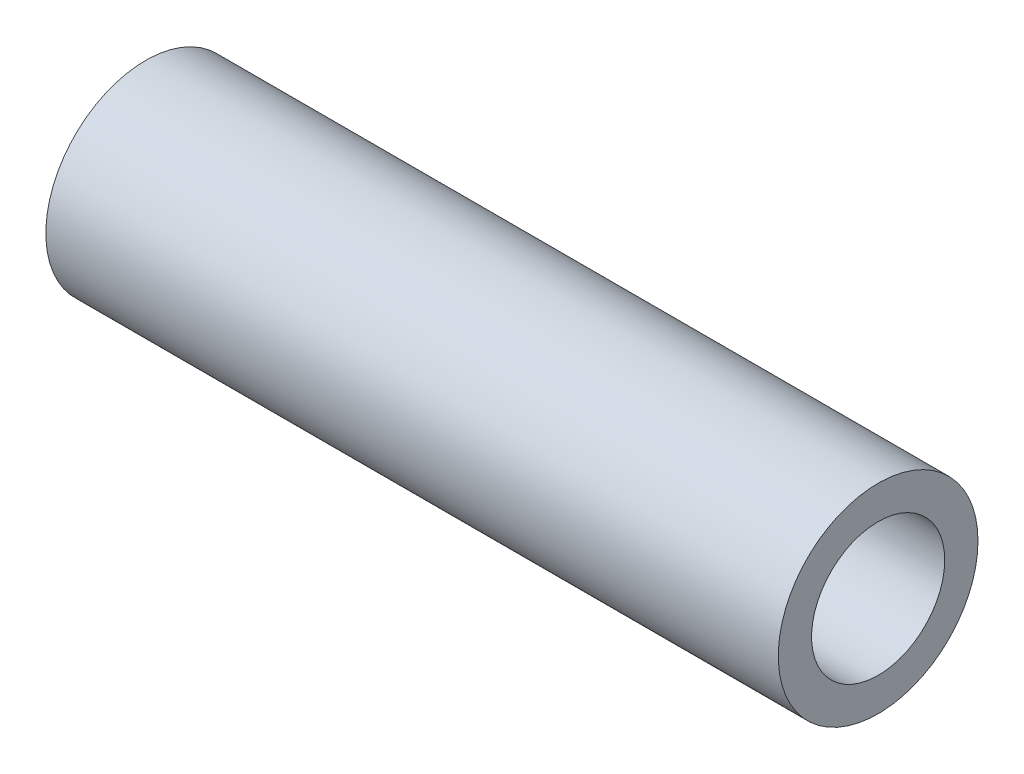
ISO-10303-21;
HEADER;
FILE_DESCRIPTION(('STEP AP214'),'2;1');
FILE_NAME('part.step','',(''),(''),'','','');
FILE_SCHEMA(('AUTOMOTIVE_DESIGN { 1 0 10303 214 1 1 1 1 }'));
ENDSEC;
DATA;
#1=APPLICATION_CONTEXT('core data for automotive mechanical design processes');
#2=APPLICATION_PROTOCOL_DEFINITION('international standard','automotive_design',2000,#1);
#3=PRODUCT_CONTEXT('',#1,'mechanical');
#4=PRODUCT('Part','Part','',(#3));
#5=PRODUCT_RELATED_PRODUCT_CATEGORY('part','',(#4));
#6=PRODUCT_DEFINITION_FORMATION('','',#4);
#7=PRODUCT_DEFINITION_CONTEXT('part definition',#1,'design');
#8=PRODUCT_DEFINITION('design','',#6,#7);
#9=PRODUCT_DEFINITION_SHAPE('','',#8);
#10=(LENGTH_UNIT() NAMED_UNIT(*) SI_UNIT(.MILLI.,.METRE.));
#11=(NAMED_UNIT(*) PLANE_ANGLE_UNIT() SI_UNIT($,.RADIAN.));
#12=(NAMED_UNIT(*) SI_UNIT($,.STERADIAN.) SOLID_ANGLE_UNIT());
#13=UNCERTAINTY_MEASURE_WITH_UNIT(LENGTH_MEASURE(1.E-05),#10,'distance_accuracy_value','');
#14=(GEOMETRIC_REPRESENTATION_CONTEXT(3) GLOBAL_UNCERTAINTY_ASSIGNED_CONTEXT((#13)) GLOBAL_UNIT_ASSIGNED_CONTEXT((#10,
#11,#12)) REPRESENTATION_CONTEXT('',''));
#15=CARTESIAN_POINT('',(0.,0.,0.));
#16=DIRECTION('',(0.,0.,1.));
#17=DIRECTION('',(1.,0.,0.));
#18=AXIS2_PLACEMENT_3D('',#15,#16,#17);
#19=CARTESIAN_POINT('',(-25.87625,0.,0.));
#20=DIRECTION('',(1.,0.,0.));
#21=DIRECTION('',(0.,0.,-1.));
#22=AXIS2_PLACEMENT_3D('',#19,#20,#21);
#23=CYLINDRICAL_SURFACE('',#22,7.05612);
#24=CARTESIAN_POINT('',(-25.87625,0.,0.));
#25=DIRECTION('',(1.,0.,0.));
#26=DIRECTION('',(0.,0.,-1.));
#27=AXIS2_PLACEMENT_3D('',#24,#25,#26);
#28=CIRCLE('',#27,7.05612);
#29=CARTESIAN_POINT('',(-25.87625,0.,-7.05612));
#30=VERTEX_POINT('',#29);
#31=EDGE_CURVE('E10',#30,#30,#28,.T.);
#32=ORIENTED_EDGE('',*,*,#31,.T.);
#33=EDGE_LOOP('',(#32));
#34=FACE_BOUND('',#33,.T.);
#35=CARTESIAN_POINT('',(25.87625,0.,0.));
#36=DIRECTION('',(1.,0.,0.));
#37=DIRECTION('',(0.,0.,-1.));
#38=AXIS2_PLACEMENT_3D('',#35,#36,#37);
#39=CIRCLE('',#38,7.05612);
#40=CARTESIAN_POINT('',(25.87625,0.,-7.05612));
#41=VERTEX_POINT('',#40);
#42=EDGE_CURVE('E40',#41,#41,#39,.T.);
#43=ORIENTED_EDGE('',*,*,#42,.F.);
#44=EDGE_LOOP('',(#43));
#45=FACE_BOUND('',#44,.T.);
#46=ADVANCED_FACE('F30',(#34,#45),#23,.T.);
#47=CARTESIAN_POINT('',(-25.87625,0.,0.));
#48=DIRECTION('',(1.,0.,0.));
#49=DIRECTION('',(0.,0.,-1.));
#50=AXIS2_PLACEMENT_3D('',#47,#48,#49);
#51=PLANE('',#50);
#52=CARTESIAN_POINT('',(-25.87625,0.,0.));
#53=DIRECTION('',(1.,0.,0.));
#54=DIRECTION('',(0.,0.,-1.));
#55=AXIS2_PLACEMENT_3D('',#52,#53,#54);
#56=CIRCLE('',#55,4.70408);
#57=CARTESIAN_POINT('',(-25.87625,0.,-4.70408));
#58=VERTEX_POINT('',#57);
#59=EDGE_CURVE('E36',#58,#58,#56,.T.);
#60=ORIENTED_EDGE('',*,*,#59,.T.);
#61=EDGE_LOOP('',(#60));
#62=FACE_BOUND('',#61,.T.);
#63=ORIENTED_EDGE('',*,*,#31,.F.);
#64=EDGE_LOOP('',(#63));
#65=FACE_BOUND('',#64,.T.);
#66=ADVANCED_FACE('F59',(#62,#65),#51,.F.);
#67=CARTESIAN_POINT('',(-25.87625,0.,0.));
#68=DIRECTION('',(1.,0.,0.));
#69=DIRECTION('',(0.,0.,-1.));
#70=AXIS2_PLACEMENT_3D('',#67,#68,#69);
#71=CYLINDRICAL_SURFACE('',#70,4.70408);
#72=ORIENTED_EDGE('',*,*,#59,.F.);
#73=EDGE_LOOP('',(#72));
#74=FACE_BOUND('',#73,.T.);
#75=CARTESIAN_POINT('',(25.87625,0.,0.));
#76=DIRECTION('',(1.,0.,0.));
#77=DIRECTION('',(0.,0.,-1.));
#78=AXIS2_PLACEMENT_3D('',#75,#76,#77);
#79=CIRCLE('',#78,4.70408);
#80=CARTESIAN_POINT('',(25.87625,0.,-4.70408));
#81=VERTEX_POINT('',#80);
#82=EDGE_CURVE('E44',#81,#81,#79,.T.);
#83=ORIENTED_EDGE('',*,*,#82,.T.);
#84=EDGE_LOOP('',(#83));
#85=FACE_BOUND('',#84,.T.);
#86=ADVANCED_FACE('F50',(#74,#85),#71,.F.);
#87=CARTESIAN_POINT('',(25.87625,0.,0.));
#88=DIRECTION('',(1.,0.,0.));
#89=DIRECTION('',(0.,0.,-1.));
#90=AXIS2_PLACEMENT_3D('',#87,#88,#89);
#91=PLANE('',#90);
#92=ORIENTED_EDGE('',*,*,#42,.T.);
#93=EDGE_LOOP('',(#92));
#94=FACE_BOUND('',#93,.T.);
#95=ORIENTED_EDGE('',*,*,#82,.F.);
#96=EDGE_LOOP('',(#95));
#97=FACE_BOUND('',#96,.T.);
#98=ADVANCED_FACE('F52',(#94,#97),#91,.T.);
#99=CLOSED_SHELL('',(#46,#66,#86,#98));
#100=MANIFOLD_SOLID_BREP('B2',#99);
#101=ADVANCED_BREP_SHAPE_REPRESENTATION('',(#18,#100),#14);
#102=SHAPE_DEFINITION_REPRESENTATION(#9,#101);
ENDSEC;
END-ISO-10303-21;
